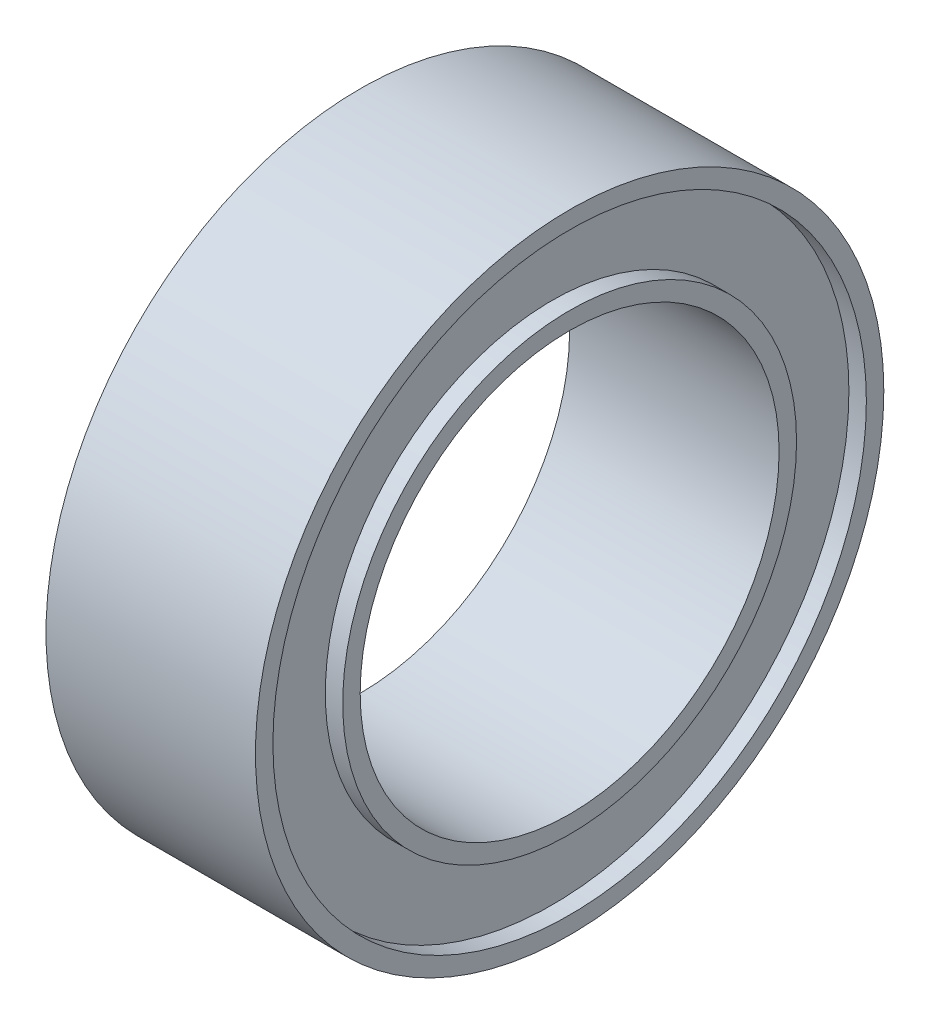
ISO-10303-21;
HEADER;
FILE_DESCRIPTION(('STEP AP214'),'2;1');
FILE_NAME('part.step','',(''),(''),'','','');
FILE_SCHEMA(('AUTOMOTIVE_DESIGN { 1 0 10303 214 1 1 1 1 }'));
ENDSEC;
DATA;
#1=APPLICATION_CONTEXT('core data for automotive mechanical design processes');
#2=APPLICATION_PROTOCOL_DEFINITION('international standard','automotive_design',2000,#1);
#3=PRODUCT_CONTEXT('',#1,'mechanical');
#4=PRODUCT('Part','Part','',(#3));
#5=PRODUCT_RELATED_PRODUCT_CATEGORY('part','',(#4));
#6=PRODUCT_DEFINITION_FORMATION('','',#4);
#7=PRODUCT_DEFINITION_CONTEXT('part definition',#1,'design');
#8=PRODUCT_DEFINITION('design','',#6,#7);
#9=PRODUCT_DEFINITION_SHAPE('','',#8);
#10=(LENGTH_UNIT() NAMED_UNIT(*) SI_UNIT(.MILLI.,.METRE.));
#11=(NAMED_UNIT(*) PLANE_ANGLE_UNIT() SI_UNIT($,.RADIAN.));
#12=(NAMED_UNIT(*) SI_UNIT($,.STERADIAN.) SOLID_ANGLE_UNIT());
#13=UNCERTAINTY_MEASURE_WITH_UNIT(LENGTH_MEASURE(1.E-05),#10,'distance_accuracy_value','');
#14=(GEOMETRIC_REPRESENTATION_CONTEXT(3) GLOBAL_UNCERTAINTY_ASSIGNED_CONTEXT((#13)) GLOBAL_UNIT_ASSIGNED_CONTEXT((#10,
#11,#12)) REPRESENTATION_CONTEXT('',''));
#15=CARTESIAN_POINT('',(0.,0.,0.));
#16=DIRECTION('',(0.,0.,1.));
#17=DIRECTION('',(1.,0.,0.));
#18=AXIS2_PLACEMENT_3D('',#15,#16,#17);
#19=CARTESIAN_POINT('',(-3.,0.,0.));
#20=DIRECTION('',(1.,0.,0.));
#21=DIRECTION('',(0.,0.,-1.));
#22=AXIS2_PLACEMENT_3D('',#19,#20,#21);
#23=PLANE('',#22);
#24=CARTESIAN_POINT('',(-3.,0.,0.));
#25=DIRECTION('',(1.,0.,0.));
#26=DIRECTION('',(0.,0.,-1.));
#27=AXIS2_PLACEMENT_3D('',#24,#25,#26);
#28=CIRCLE('',#27,6.);
#29=CARTESIAN_POINT('',(-3.,0.,-6.));
#30=VERTEX_POINT('',#29);
#31=EDGE_CURVE('E44',#30,#30,#28,.T.);
#32=ORIENTED_EDGE('',*,*,#31,.T.);
#33=EDGE_LOOP('',(#32));
#34=FACE_BOUND('',#33,.T.);
#35=CARTESIAN_POINT('',(-3.,0.,0.));
#36=DIRECTION('',(1.,0.,0.));
#37=DIRECTION('',(0.,0.,-1.));
#38=AXIS2_PLACEMENT_3D('',#35,#36,#37);
#39=CIRCLE('',#38,6.50000000000001);
#40=CARTESIAN_POINT('',(-3.,0.,-6.50000000000001));
#41=VERTEX_POINT('',#40);
#42=EDGE_CURVE('E68',#41,#41,#39,.T.);
#43=ORIENTED_EDGE('',*,*,#42,.F.);
#44=EDGE_LOOP('',(#43));
#45=FACE_BOUND('',#44,.T.);
#46=ADVANCED_FACE('F33',(#34,#45),#23,.F.);
#47=CARTESIAN_POINT('',(3.,0.,0.));
#48=DIRECTION('',(1.,0.,0.));
#49=DIRECTION('',(0.,0.,-1.));
#50=AXIS2_PLACEMENT_3D('',#47,#48,#49);
#51=PLANE('',#50);
#52=CARTESIAN_POINT('',(3.,0.,0.));
#53=DIRECTION('',(1.,0.,0.));
#54=DIRECTION('',(0.,0.,-1.));
#55=AXIS2_PLACEMENT_3D('',#52,#53,#54);
#56=CIRCLE('',#55,6.);
#57=CARTESIAN_POINT('',(3.,0.,-6.));
#58=VERTEX_POINT('',#57);
#59=EDGE_CURVE('E46',#58,#58,#56,.T.);
#60=ORIENTED_EDGE('',*,*,#59,.F.);
#61=EDGE_LOOP('',(#60));
#62=FACE_BOUND('',#61,.T.);
#63=CARTESIAN_POINT('',(3.,0.,0.));
#64=DIRECTION('',(1.,0.,0.));
#65=DIRECTION('',(0.,0.,-1.));
#66=AXIS2_PLACEMENT_3D('',#63,#64,#65);
#67=CIRCLE('',#66,6.50000000000001);
#68=CARTESIAN_POINT('',(3.,0.,-6.50000000000001));
#69=VERTEX_POINT('',#68);
#70=EDGE_CURVE('E56',#69,#69,#67,.T.);
#71=ORIENTED_EDGE('',*,*,#70,.T.);
#72=EDGE_LOOP('',(#71));
#73=FACE_BOUND('',#72,.T.);
#74=ADVANCED_FACE('F88',(#62,#73),#51,.T.);
#75=CARTESIAN_POINT('',(3.,0.,0.));
#76=DIRECTION('',(-1.,0.,0.));
#77=DIRECTION('',(0.,0.,1.));
#78=AXIS2_PLACEMENT_3D('',#75,#76,#77);
#79=CYLINDRICAL_SURFACE('',#78,9.);
#80=CARTESIAN_POINT('',(3.,0.,0.));
#81=DIRECTION('',(1.,0.,0.));
#82=DIRECTION('',(0.,0.,-1.));
#83=AXIS2_PLACEMENT_3D('',#80,#81,#82);
#84=CIRCLE('',#83,9.);
#85=CARTESIAN_POINT('',(3.,0.,-9.));
#86=VERTEX_POINT('',#85);
#87=EDGE_CURVE('E10',#86,#86,#84,.T.);
#88=ORIENTED_EDGE('',*,*,#87,.F.);
#89=EDGE_LOOP('',(#88));
#90=FACE_BOUND('',#89,.T.);
#91=CARTESIAN_POINT('',(-3.,0.,0.));
#92=DIRECTION('',(1.,0.,0.));
#93=DIRECTION('',(0.,0.,-1.));
#94=AXIS2_PLACEMENT_3D('',#91,#92,#93);
#95=CIRCLE('',#94,9.);
#96=CARTESIAN_POINT('',(-3.,0.,-9.));
#97=VERTEX_POINT('',#96);
#98=EDGE_CURVE('E37',#97,#97,#95,.T.);
#99=ORIENTED_EDGE('',*,*,#98,.T.);
#100=EDGE_LOOP('',(#99));
#101=FACE_BOUND('',#100,.T.);
#102=ADVANCED_FACE('F35',(#90,#101),#79,.T.);
#103=CARTESIAN_POINT('',(3.,0.,0.));
#104=DIRECTION('',(1.,0.,0.));
#105=DIRECTION('',(0.,0.,-1.));
#106=AXIS2_PLACEMENT_3D('',#103,#104,#105);
#107=CIRCLE('',#106,8.50000000000001);
#108=CARTESIAN_POINT('',(3.,0.,-8.50000000000001));
#109=VERTEX_POINT('',#108);
#110=EDGE_CURVE('E52',#109,#109,#107,.T.);
#111=ORIENTED_EDGE('',*,*,#110,.F.);
#112=EDGE_LOOP('',(#111));
#113=FACE_BOUND('',#112,.T.);
#114=ORIENTED_EDGE('',*,*,#87,.T.);
#115=EDGE_LOOP('',(#114));
#116=FACE_BOUND('',#115,.T.);
#117=ADVANCED_FACE('F96',(#113,#116),#51,.T.);
#118=CARTESIAN_POINT('',(-3.,0.,0.));
#119=DIRECTION('',(1.,0.,0.));
#120=DIRECTION('',(0.,0.,-1.));
#121=AXIS2_PLACEMENT_3D('',#118,#119,#120);
#122=CIRCLE('',#121,8.50000000000001);
#123=CARTESIAN_POINT('',(-3.,0.,-8.50000000000001));
#124=VERTEX_POINT('',#123);
#125=EDGE_CURVE('E64',#124,#124,#122,.T.);
#126=ORIENTED_EDGE('',*,*,#125,.T.);
#127=EDGE_LOOP('',(#126));
#128=FACE_BOUND('',#127,.T.);
#129=ORIENTED_EDGE('',*,*,#98,.F.);
#130=EDGE_LOOP('',(#129));
#131=FACE_BOUND('',#130,.T.);
#132=ADVANCED_FACE('F90',(#128,#131),#23,.F.);
#133=CARTESIAN_POINT('',(-3.,0.,0.));
#134=DIRECTION('',(1.,0.,0.));
#135=DIRECTION('',(0.,0.,-1.));
#136=AXIS2_PLACEMENT_3D('',#133,#134,#135);
#137=CYLINDRICAL_SURFACE('',#136,6.);
#138=ORIENTED_EDGE('',*,*,#31,.F.);
#139=EDGE_LOOP('',(#138));
#140=FACE_BOUND('',#139,.T.);
#141=ORIENTED_EDGE('',*,*,#59,.T.);
#142=EDGE_LOOP('',(#141));
#143=FACE_BOUND('',#142,.T.);
#144=ADVANCED_FACE('F98',(#140,#143),#137,.F.);
#145=CARTESIAN_POINT('',(2.5,0.,0.));
#146=DIRECTION('',(1.,0.,0.));
#147=DIRECTION('',(0.,0.,-1.));
#148=AXIS2_PLACEMENT_3D('',#145,#146,#147);
#149=CYLINDRICAL_SURFACE('',#148,6.50000000000001);
#150=CARTESIAN_POINT('',(2.5,0.,0.));
#151=DIRECTION('',(1.,0.,0.));
#152=DIRECTION('',(0.,0.,-1.));
#153=AXIS2_PLACEMENT_3D('',#150,#151,#152);
#154=CIRCLE('',#153,6.50000000000001);
#155=CARTESIAN_POINT('',(2.5,0.,-6.50000000000001));
#156=VERTEX_POINT('',#155);
#157=EDGE_CURVE('E55',#156,#156,#154,.T.);
#158=ORIENTED_EDGE('',*,*,#157,.T.);
#159=EDGE_LOOP('',(#158));
#160=FACE_BOUND('',#159,.T.);
#161=ORIENTED_EDGE('',*,*,#70,.F.);
#162=EDGE_LOOP('',(#161));
#163=FACE_BOUND('',#162,.T.);
#164=ADVANCED_FACE('F104',(#160,#163),#149,.T.);
#165=CARTESIAN_POINT('',(2.5,0.,0.));
#166=DIRECTION('',(1.,0.,0.));
#167=DIRECTION('',(0.,0.,-1.));
#168=AXIS2_PLACEMENT_3D('',#165,#166,#167);
#169=CYLINDRICAL_SURFACE('',#168,8.50000000000001);
#170=CARTESIAN_POINT('',(2.5,0.,0.));
#171=DIRECTION('',(1.,0.,0.));
#172=DIRECTION('',(0.,0.,-1.));
#173=AXIS2_PLACEMENT_3D('',#170,#171,#172);
#174=CIRCLE('',#173,8.50000000000001);
#175=CARTESIAN_POINT('',(2.5,0.,-8.50000000000001));
#176=VERTEX_POINT('',#175);
#177=EDGE_CURVE('E49',#176,#176,#174,.T.);
#178=ORIENTED_EDGE('',*,*,#177,.F.);
#179=EDGE_LOOP('',(#178));
#180=FACE_BOUND('',#179,.T.);
#181=ORIENTED_EDGE('',*,*,#110,.T.);
#182=EDGE_LOOP('',(#181));
#183=FACE_BOUND('',#182,.T.);
#184=ADVANCED_FACE('F184',(#180,#183),#169,.F.);
#185=CARTESIAN_POINT('',(2.5,0.,0.));
#186=DIRECTION('',(1.,0.,0.));
#187=DIRECTION('',(0.,0.,-1.));
#188=AXIS2_PLACEMENT_3D('',#185,#186,#187);
#189=PLANE('',#188);
#190=ORIENTED_EDGE('',*,*,#157,.F.);
#191=EDGE_LOOP('',(#190));
#192=FACE_BOUND('',#191,.T.);
#193=ORIENTED_EDGE('',*,*,#177,.T.);
#194=EDGE_LOOP('',(#193));
#195=FACE_BOUND('',#194,.T.);
#196=ADVANCED_FACE('F83',(#192,#195),#189,.T.);
#197=CARTESIAN_POINT('',(-2.5,0.,0.));
#198=DIRECTION('',(-1.,0.,0.));
#199=DIRECTION('',(0.,0.,1.));
#200=AXIS2_PLACEMENT_3D('',#197,#198,#199);
#201=CYLINDRICAL_SURFACE('',#200,6.50000000000001);
#202=CARTESIAN_POINT('',(-2.5,0.,0.));
#203=DIRECTION('',(1.,0.,0.));
#204=DIRECTION('',(0.,0.,-1.));
#205=AXIS2_PLACEMENT_3D('',#202,#203,#204);
#206=CIRCLE('',#205,6.50000000000001);
#207=CARTESIAN_POINT('',(-2.5,0.,-6.50000000000001));
#208=VERTEX_POINT('',#207);
#209=EDGE_CURVE('E67',#208,#208,#206,.T.);
#210=ORIENTED_EDGE('',*,*,#209,.F.);
#211=EDGE_LOOP('',(#210));
#212=FACE_BOUND('',#211,.T.);
#213=ORIENTED_EDGE('',*,*,#42,.T.);
#214=EDGE_LOOP('',(#213));
#215=FACE_BOUND('',#214,.T.);
#216=ADVANCED_FACE('F79',(#212,#215),#201,.T.);
#217=CARTESIAN_POINT('',(-2.5,0.,0.));
#218=DIRECTION('',(-1.,0.,0.));
#219=DIRECTION('',(0.,0.,1.));
#220=AXIS2_PLACEMENT_3D('',#217,#218,#219);
#221=CYLINDRICAL_SURFACE('',#220,8.50000000000001);
#222=CARTESIAN_POINT('',(-2.5,0.,0.));
#223=DIRECTION('',(1.,0.,0.));
#224=DIRECTION('',(0.,0.,-1.));
#225=AXIS2_PLACEMENT_3D('',#222,#223,#224);
#226=CIRCLE('',#225,8.50000000000001);
#227=CARTESIAN_POINT('',(-2.5,0.,-8.50000000000001));
#228=VERTEX_POINT('',#227);
#229=EDGE_CURVE('E59',#228,#228,#226,.T.);
#230=ORIENTED_EDGE('',*,*,#229,.T.);
#231=EDGE_LOOP('',(#230));
#232=FACE_BOUND('',#231,.T.);
#233=ORIENTED_EDGE('',*,*,#125,.F.);
#234=EDGE_LOOP('',(#233));
#235=FACE_BOUND('',#234,.T.);
#236=ADVANCED_FACE('F82',(#232,#235),#221,.F.);
#237=CARTESIAN_POINT('',(-2.5,0.,0.));
#238=DIRECTION('',(-1.,0.,0.));
#239=DIRECTION('',(0.,0.,-1.));
#240=AXIS2_PLACEMENT_3D('',#237,#238,#239);
#241=PLANE('',#240);
#242=ORIENTED_EDGE('',*,*,#209,.T.);
#243=EDGE_LOOP('',(#242));
#244=FACE_BOUND('',#243,.T.);
#245=ORIENTED_EDGE('',*,*,#229,.F.);
#246=EDGE_LOOP('',(#245));
#247=FACE_BOUND('',#246,.T.);
#248=ADVANCED_FACE('F76',(#244,#247),#241,.T.);
#249=CLOSED_SHELL('',(#46,#74,#102,#117,#132,#144,#164,#184,#196,#216,#236,#248));
#250=MANIFOLD_SOLID_BREP('B2',#249);
#251=ADVANCED_BREP_SHAPE_REPRESENTATION('',(#18,#250),#14);
#252=SHAPE_DEFINITION_REPRESENTATION(#9,#251);
ENDSEC;
END-ISO-10303-21;
